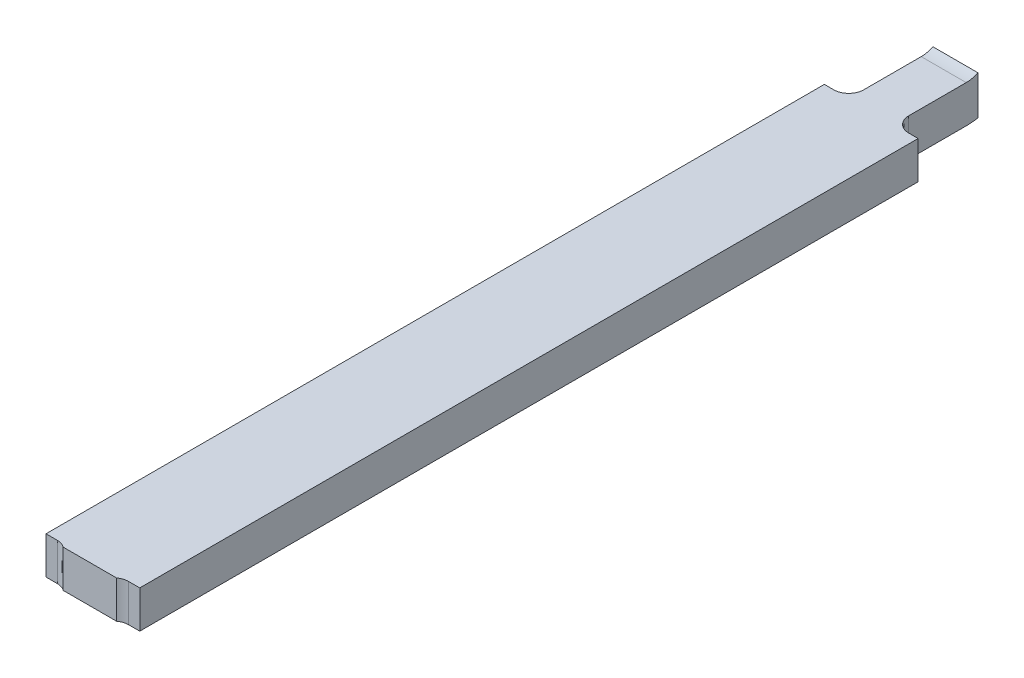
ISO-10303-21;
HEADER;
FILE_DESCRIPTION(('STEP AP214'),'2;1');
FILE_NAME('part.step','',(''),(''),'','','');
FILE_SCHEMA(('AUTOMOTIVE_DESIGN { 1 0 10303 214 1 1 1 1 }'));
ENDSEC;
DATA;
#1=APPLICATION_CONTEXT('core data for automotive mechanical design processes');
#2=APPLICATION_PROTOCOL_DEFINITION('international standard','automotive_design',2000,#1);
#3=PRODUCT_CONTEXT('',#1,'mechanical');
#4=PRODUCT('Part','Part','',(#3));
#5=PRODUCT_RELATED_PRODUCT_CATEGORY('part','',(#4));
#6=PRODUCT_DEFINITION_FORMATION('','',#4);
#7=PRODUCT_DEFINITION_CONTEXT('part definition',#1,'design');
#8=PRODUCT_DEFINITION('design','',#6,#7);
#9=PRODUCT_DEFINITION_SHAPE('','',#8);
#10=(LENGTH_UNIT() NAMED_UNIT(*) SI_UNIT(.MILLI.,.METRE.));
#11=(NAMED_UNIT(*) PLANE_ANGLE_UNIT() SI_UNIT($,.RADIAN.));
#12=(NAMED_UNIT(*) SI_UNIT($,.STERADIAN.) SOLID_ANGLE_UNIT());
#13=UNCERTAINTY_MEASURE_WITH_UNIT(LENGTH_MEASURE(1.E-05),#10,'distance_accuracy_value','');
#14=(GEOMETRIC_REPRESENTATION_CONTEXT(3) GLOBAL_UNCERTAINTY_ASSIGNED_CONTEXT((#13)) GLOBAL_UNIT_ASSIGNED_CONTEXT((#10,
#11,#12)) REPRESENTATION_CONTEXT('',''));
#15=CARTESIAN_POINT('',(0.,0.,0.));
#16=DIRECTION('',(0.,0.,1.));
#17=DIRECTION('',(1.,0.,0.));
#18=AXIS2_PLACEMENT_3D('',#15,#16,#17);
#19=CARTESIAN_POINT('',(3.,-0.3652289464185,-7.500488855463));
#20=DIRECTION('',(0.,0.,1.));
#21=DIRECTION('',(1.,0.,0.));
#22=AXIS2_PLACEMENT_3D('',#19,#20,#21);
#23=PLANE('',#22);
#24=DIRECTION('',(0.,1.,0.));
#25=VECTOR('',#24,1.);
#26=CARTESIAN_POINT('',(3.12,-0.3694122088881,-7.500488855463));
#27=LINE('',#26,#25);
#28=CARTESIAN_POINT('',(3.12,-0.469296338681694,-7.50048885546298));
#29=VERTEX_POINT('',#28);
#30=CARTESIAN_POINT('',(3.12,-0.261161554155171,-7.50048885546301));
#31=VERTEX_POINT('',#30);
#32=EDGE_CURVE('E150',#29,#31,#27,.T.);
#33=ORIENTED_EDGE('',*,*,#32,.F.);
#34=DIRECTION('',(-1.,0.,0.));
#35=VECTOR('',#34,1.);
#36=CARTESIAN_POINT('',(3.125727283719,-0.469296338681697,-7.50048885546296));
#37=LINE('',#36,#35);
#38=CARTESIAN_POINT('',(2.88,-0.469296338681694,-7.50048885546298));
#39=VERTEX_POINT('',#38);
#40=EDGE_CURVE('E139',#39,#29,#37,.F.);
#41=ORIENTED_EDGE('',*,*,#40,.F.);
#42=DIRECTION('',(0.,1.,0.));
#43=VECTOR('',#42,1.);
#44=CARTESIAN_POINT('',(2.88,-0.3694122088881,-7.500488855463));
#45=LINE('',#44,#43);
#46=CARTESIAN_POINT('',(2.88,-0.261161554155171,-7.50048885546301));
#47=VERTEX_POINT('',#46);
#48=EDGE_CURVE('E535',#39,#47,#45,.T.);
#49=ORIENTED_EDGE('',*,*,#48,.T.);
#50=DIRECTION('',(1.,0.,0.));
#51=VECTOR('',#50,1.);
#52=CARTESIAN_POINT('',(2.874272716281,-0.261161554155164,-7.50048885546303));
#53=LINE('',#52,#51);
#54=EDGE_CURVE('E147',#47,#31,#53,.T.);
#55=ORIENTED_EDGE('',*,*,#54,.T.);
#56=EDGE_LOOP('',(#33,#41,#49,#55));
#57=FACE_BOUND('',#56,.T.);
#58=ADVANCED_FACE('F17',(#57),#23,.F.);
#59=CARTESIAN_POINT('',(3.125727283719,-0.125,-7.43756007691));
#60=DIRECTION('',(-1.,0.,0.));
#61=DIRECTION('',(0.,0.,1.));
#62=AXIS2_PLACEMENT_3D('',#59,#60,#61);
#63=CYLINDRICAL_SURFACE('',#62,0.3499999999997);
#64=CARTESIAN_POINT('',(2.88,-0.125,-7.43756007691));
#65=DIRECTION('',(-1.,0.,0.));
#66=DIRECTION('',(0.,0.,1.));
#67=AXIS2_PLACEMENT_3D('',#64,#65,#66);
#68=CIRCLE('',#67,0.3499999999997);
#69=CARTESIAN_POINT('',(2.88,-0.475,-7.43756007691));
#70=VERTEX_POINT('',#69);
#71=EDGE_CURVE('E250',#70,#39,#68,.F.);
#72=ORIENTED_EDGE('',*,*,#71,.T.);
#73=ORIENTED_EDGE('',*,*,#40,.T.);
#74=CARTESIAN_POINT('',(3.12,-0.125,-7.43756007691));
#75=DIRECTION('',(-1.,0.,0.));
#76=DIRECTION('',(0.,0.,1.));
#77=AXIS2_PLACEMENT_3D('',#74,#75,#76);
#78=CIRCLE('',#77,0.3499999999997);
#79=CARTESIAN_POINT('',(3.12,-0.475,-7.43756007691));
#80=VERTEX_POINT('',#79);
#81=EDGE_CURVE('E274',#80,#29,#78,.F.);
#82=ORIENTED_EDGE('',*,*,#81,.F.);
#83=DIRECTION('',(1.,0.,0.));
#84=VECTOR('',#83,1.);
#85=CARTESIAN_POINT('',(3.,-0.475,-7.43756007691));
#86=LINE('',#85,#84);
#87=EDGE_CURVE('E138',#80,#70,#86,.F.);
#88=ORIENTED_EDGE('',*,*,#87,.T.);
#89=EDGE_LOOP('',(#72,#73,#82,#88));
#90=FACE_BOUND('',#89,.T.);
#91=ADVANCED_FACE('F255',(#90),#63,.T.);
#92=CARTESIAN_POINT('',(3.,-0.475,-5.160844573418));
#93=DIRECTION('',(0.,1.,0.));
#94=DIRECTION('',(0.,0.,1.));
#95=AXIS2_PLACEMENT_3D('',#92,#93,#94);
#96=PLANE('',#95);
#97=DIRECTION('',(1.,0.,0.));
#98=VECTOR('',#97,1.);
#99=CARTESIAN_POINT('',(3.,-0.475,-2.9));
#100=LINE('',#99,#98);
#101=CARTESIAN_POINT('',(2.75,-0.475,-2.9));
#102=VERTEX_POINT('',#101);
#103=CARTESIAN_POINT('',(2.81,-0.475,-2.89999999999976));
#104=VERTEX_POINT('',#103);
#105=EDGE_CURVE('E118',#102,#104,#100,.T.);
#106=ORIENTED_EDGE('',*,*,#105,.F.);
#107=DIRECTION('',(0.,0.,-1.));
#108=VECTOR('',#107,1.);
#109=CARTESIAN_POINT('',(2.75,-0.475,-4.975579331992));
#110=LINE('',#109,#108);
#111=CARTESIAN_POINT('',(2.75,-0.475,-7.051158663985));
#112=VERTEX_POINT('',#111);
#113=EDGE_CURVE('E213',#102,#112,#110,.T.);
#114=ORIENTED_EDGE('',*,*,#113,.T.);
#115=DIRECTION('',(1.,0.,0.));
#116=VECTOR('',#115,1.);
#117=CARTESIAN_POINT('',(2.775,-0.475,-7.051158663985));
#118=LINE('',#117,#116);
#119=CARTESIAN_POINT('',(2.8,-0.475,-7.05115866398505));
#120=VERTEX_POINT('',#119);
#121=EDGE_CURVE('E218',#112,#120,#118,.T.);
#122=ORIENTED_EDGE('',*,*,#121,.T.);
#123=CARTESIAN_POINT('',(2.88000000000032,-0.475,-7.131158663985));
#124=CARTESIAN_POINT('',(2.87999112440513,-0.475,-7.12663228539964));
#125=CARTESIAN_POINT('',(2.87960496952686,-0.475,-7.12211245444064));
#126=CARTESIAN_POINT('',(2.87808437325865,-0.475,-7.11320506981294));
#127=CARTESIAN_POINT('',(2.87695060689905,-0.475,-7.10881740054697));
#128=CARTESIAN_POINT('',(2.87244381446599,-0.475,-7.09604021502532));
#129=CARTESIAN_POINT('',(2.86796518134959,-0.475,-7.08801257629076));
#130=CARTESIAN_POINT('',(2.85665881135733,-0.475,-7.07397145931291));
#131=CARTESIAN_POINT('',(2.84985092513136,-0.475,-7.06794178198465));
#132=CARTESIAN_POINT('',(2.83457018431965,-0.475,-7.05845747919414));
#133=CARTESIAN_POINT('',(2.82608908375478,-0.475,-7.05501603051907));
#134=CARTESIAN_POINT('',(2.81161549132932,-0.475,-7.05178938735803));
#135=CARTESIAN_POINT('',(2.80580339960844,-0.475,-7.05114165155808));
#136=CARTESIAN_POINT('',(2.8,-0.475,-7.05115866398511));
#137=B_SPLINE_CURVE_WITH_KNOTS('',3,(#123,#124,#125,#126,#127,#128,#129,#130,#131,#132,#133,
#134,#135,#136),.UNSPECIFIED.,.F.,.F.,(4,2,2,2,2,2,4),(0.,0.0135512792184664,0.0270903394942172,
0.0541002294469011,0.080885440746927,0.107806110463965,0.125207976056706),.UNSPECIFIED.);
#138=CARTESIAN_POINT('',(2.88000000000016,-0.475,-7.131158663985));
#139=VERTEX_POINT('',#138);
#140=EDGE_CURVE('E239',#139,#120,#137,.T.);
#141=ORIENTED_EDGE('',*,*,#140,.F.);
#142=DIRECTION('',(0.,0.,-1.));
#143=VECTOR('',#142,1.);
#144=CARTESIAN_POINT('',(2.88,-0.475,-7.317732357319));
#145=LINE('',#144,#143);
#146=EDGE_CURVE('E537',#139,#70,#145,.T.);
#147=ORIENTED_EDGE('',*,*,#146,.T.);
#148=ORIENTED_EDGE('',*,*,#87,.F.);
#149=DIRECTION('',(0.,0.,-1.));
#150=VECTOR('',#149,1.);
#151=CARTESIAN_POINT('',(3.12,-0.475,-7.317732357319));
#152=LINE('',#151,#150);
#153=CARTESIAN_POINT('',(3.12000000000005,-0.475,-7.131158663985));
#154=VERTEX_POINT('',#153);
#155=EDGE_CURVE('E533',#154,#80,#152,.T.);
#156=ORIENTED_EDGE('',*,*,#155,.F.);
#157=CARTESIAN_POINT('',(3.2,-0.475,-7.05115866398468));
#158=CARTESIAN_POINT('',(3.19547362141464,-0.475,-7.05116753957987));
#159=CARTESIAN_POINT('',(3.19095379045565,-0.475,-7.05155369445814));
#160=CARTESIAN_POINT('',(3.18204640582795,-0.475,-7.05307429072634));
#161=CARTESIAN_POINT('',(3.17765873656198,-0.475,-7.05420805708594));
#162=CARTESIAN_POINT('',(3.16488155104034,-0.475,-7.058714849519));
#163=CARTESIAN_POINT('',(3.15685391230579,-0.475,-7.06319348263539));
#164=CARTESIAN_POINT('',(3.14281279532794,-0.475,-7.07449985262764));
#165=CARTESIAN_POINT('',(3.13678311799969,-0.475,-7.0813077388536));
#166=CARTESIAN_POINT('',(3.12729881520917,-0.475,-7.0965884796653));
#167=CARTESIAN_POINT('',(3.12385736653408,-0.475,-7.10506958023018));
#168=CARTESIAN_POINT('',(3.12063072337303,-0.475,-7.11954317265566));
#169=CARTESIAN_POINT('',(3.11998298757307,-0.475,-7.12535526437655));
#170=CARTESIAN_POINT('',(3.12000000000011,-0.475,-7.131158663985));
#171=B_SPLINE_CURVE_WITH_KNOTS('',3,(#157,#158,#159,#160,#161,#162,#163,#164,#165,#166,#167,
#168,#169,#170),.UNSPECIFIED.,.F.,.F.,(4,2,2,2,2,2,4),(0.,0.0135512792184578,0.0270903394941992,
0.0541002294468632,0.0808854407468641,0.107806110463927,0.125207976056708),.UNSPECIFIED.);
#172=CARTESIAN_POINT('',(3.2,-0.475,-7.05115866398484));
#173=VERTEX_POINT('',#172);
#174=EDGE_CURVE('E266',#173,#154,#171,.T.);
#175=ORIENTED_EDGE('',*,*,#174,.F.);
#176=DIRECTION('',(1.,0.,0.));
#177=VECTOR('',#176,1.);
#178=CARTESIAN_POINT('',(3.225,-0.475,-7.051158663985));
#179=LINE('',#178,#177);
#180=CARTESIAN_POINT('',(3.25,-0.475,-7.051158663985));
#181=VERTEX_POINT('',#180);
#182=EDGE_CURVE('E151',#173,#181,#179,.T.);
#183=ORIENTED_EDGE('',*,*,#182,.T.);
#184=DIRECTION('',(0.,0.,-1.));
#185=VECTOR('',#184,1.);
#186=CARTESIAN_POINT('',(3.25,-0.475,-4.975579331992));
#187=LINE('',#186,#185);
#188=CARTESIAN_POINT('',(3.25,-0.475,-2.9));
#189=VERTEX_POINT('',#188);
#190=EDGE_CURVE('E155',#189,#181,#187,.T.);
#191=ORIENTED_EDGE('',*,*,#190,.F.);
#192=DIRECTION('',(1.,0.,0.));
#193=VECTOR('',#192,1.);
#194=CARTESIAN_POINT('',(3.22,-0.475,-2.9));
#195=LINE('',#194,#193);
#196=CARTESIAN_POINT('',(3.19,-0.475,-2.89999999999989));
#197=VERTEX_POINT('',#196);
#198=EDGE_CURVE('E163',#197,#189,#195,.T.);
#199=ORIENTED_EDGE('',*,*,#198,.F.);
#200=CARTESIAN_POINT('',(3.14217544757885,-0.475,-2.8841290699251));
#201=CARTESIAN_POINT('',(3.14622022070471,-0.475,-2.88715347788678));
#202=CARTESIAN_POINT('',(3.1505544258207,-0.475,-2.88978498732686));
#203=CARTESIAN_POINT('',(3.15913369497632,-0.475,-2.8939430866676));
#204=CARTESIAN_POINT('',(3.16333518410899,-0.475,-2.89555994023161));
#205=CARTESIAN_POINT('',(3.17194880942199,-0.475,-2.89806057790455));
#206=CARTESIAN_POINT('',(3.17636081104943,-0.475,-2.89894482380699));
#207=CARTESIAN_POINT('',(3.18386363483118,-0.475,-2.89981357444961));
#208=CARTESIAN_POINT('',(3.18693284156798,-0.475,-2.89999375978714));
#209=CARTESIAN_POINT('',(3.19,-0.475,-2.89999999999978));
#210=B_SPLINE_CURVE_WITH_KNOTS('',3,(#200,#201,#202,#203,#204,#205,#206,#207,#208,#209),
.UNSPECIFIED.,.F.,.F.,(4,2,2,2,4),(0.,0.0151223248428414,0.0285648972663061,0.0419989898086721,
0.0512012871013961),.UNSPECIFIED.);
#211=CARTESIAN_POINT('',(3.14217544757892,-0.475,-2.88412906992505));
#212=VERTEX_POINT('',#211);
#213=EDGE_CURVE('E125',#212,#197,#210,.T.);
#214=ORIENTED_EDGE('',*,*,#213,.F.);
#215=DIRECTION('',(1.,0.,0.));
#216=VECTOR('',#215,1.);
#217=CARTESIAN_POINT('',(3.,-0.475,-2.884129069925));
#218=LINE('',#217,#216);
#219=CARTESIAN_POINT('',(2.85782456637205,-0.475,-2.88412906992502));
#220=VERTEX_POINT('',#219);
#221=EDGE_CURVE('E129',#220,#212,#218,.T.);
#222=ORIENTED_EDGE('',*,*,#221,.F.);
#223=CARTESIAN_POINT('',(2.81,-0.475,-2.89999999999952));
#224=CARTESIAN_POINT('',(2.81503269638164,-0.475,-2.90001482409384));
#225=CARTESIAN_POINT('',(2.82008184216692,-0.475,-2.89952557596737));
#226=CARTESIAN_POINT('',(2.83385228395105,-0.475,-2.89686256447201));
#227=CARTESIAN_POINT('',(2.84239947608122,-0.475,-2.89367998586962));
#228=CARTESIAN_POINT('',(2.85280786570125,-0.475,-2.88765952253235));
#229=CARTESIAN_POINT('',(2.85537440128386,-0.475,-2.88596721904186));
#230=CARTESIAN_POINT('',(2.8578245663721,-0.475,-2.88412906992503));
#231=B_SPLINE_CURVE_WITH_KNOTS('',3,(#223,#224,#225,#226,#227,#228,#229,#230),.UNSPECIFIED.,.F.,
.F.,(4,2,2,4),(0.,0.0151178951010498,0.0419060489798819,0.051106340202069),.UNSPECIFIED.);
#232=EDGE_CURVE('E20',#104,#220,#231,.T.);
#233=ORIENTED_EDGE('',*,*,#232,.F.);
#234=EDGE_LOOP('',(#106,#114,#122,#141,#147,#148,#156,#175,#183,#191,#199,#214,#222,#233));
#235=FACE_BOUND('',#234,.T.);
#236=ADVANCED_FACE('F135',(#235),#96,.F.);
#237=CARTESIAN_POINT('',(3.192867608479,-0.269272716281,-2.899957930186));
#238=CARTESIAN_POINT('',(3.191912675517,-0.269272716281,-2.899988554812));
#239=CARTESIAN_POINT('',(3.185731487658,-0.269272716281,-2.900079343105));
#240=CARTESIAN_POINT('',(3.174291413689,-0.269272716281,-2.898963559635));
#241=CARTESIAN_POINT('',(3.159190917084,-0.269272716281,-2.894390814224));
#242=CARTESIAN_POINT('',(3.1486873263,-0.269272716281,-2.888776760997));
#243=CARTESIAN_POINT('',(3.141721023167,-0.269272716281,-2.883851645707));
#244=CARTESIAN_POINT('',(3.139152051861,-0.269272716281,-2.881786274905));
#245=CARTESIAN_POINT('',(3.137705478113,-0.269272716281,-2.880535760884));
#246=(BOUNDED_CURVE() B_SPLINE_CURVE(3,(#237,#238,#239,#240,#241,#242,#243,#244,#245),
.UNSPECIFIED.,.F.,.F.) B_SPLINE_CURVE_WITH_KNOTS((4,1,1,1,1,1,4),(0.,0.04800761260771,
0.3103664664067,0.5726487803877,0.8349383013298,0.9041878403074,1.),
.UNSPECIFIED.) CURVE() GEOMETRIC_REPRESENTATION_ITEM() RATIONAL_B_SPLINE_CURVE((1.,1.,1.,1.,1.,
1.,1.,1.,1.)) REPRESENTATION_ITEM(''));
#247=DIRECTION('',(0.,-1.,0.));
#248=VECTOR('',#247,1.);
#249=SURFACE_OF_LINEAR_EXTRUSION('',#246,#248);
#250=CARTESIAN_POINT('',(3.14217544464746,-0.275,-2.88412906773656));
#251=CARTESIAN_POINT('',(3.14622021763433,-0.275,-2.88715347588347));
#252=CARTESIAN_POINT('',(3.15055442262976,-0.275,-2.88978498552233));
#253=CARTESIAN_POINT('',(3.15913369159402,-0.275,-2.89394308525624));
#254=CARTESIAN_POINT('',(3.16333518065168,-0.275,-2.89555993901277));
#255=CARTESIAN_POINT('',(3.17194880584974,-0.275,-2.89806057708111));
#256=CARTESIAN_POINT('',(3.17636080743733,-0.275,-2.89894482318606));
#257=CARTESIAN_POINT('',(3.18386363239327,-0.275,-2.89981357430863));
#258=CARTESIAN_POINT('',(3.18693284034916,-0.275,-2.89999375978684));
#259=CARTESIAN_POINT('',(3.19,-0.275,-2.89999999999978));
#260=B_SPLINE_CURVE_WITH_KNOTS('',3,(#250,#251,#252,#253,#254,#255,#256,#257,#258,#259),
.UNSPECIFIED.,.F.,.F.,(4,2,2,2,4),(0.,0.015122324842671,0.0285648972632469,0.041998989809668,
0.0512012907536534),.UNSPECIFIED.);
#261=CARTESIAN_POINT('',(3.14217544611323,-0.275,-2.88412906883078));
#262=VERTEX_POINT('',#261);
#263=CARTESIAN_POINT('',(3.19,-0.275,-2.9));
#264=VERTEX_POINT('',#263);
#265=EDGE_CURVE('E132',#262,#264,#260,.T.);
#266=ORIENTED_EDGE('',*,*,#265,.F.);
#267=DIRECTION('',(0.,1.,0.));
#268=VECTOR('',#267,1.);
#269=CARTESIAN_POINT('',(3.142175447579,-0.375,-2.884129069925));
#270=LINE('',#269,#268);
#271=EDGE_CURVE('E133',#212,#262,#270,.T.);
#272=ORIENTED_EDGE('',*,*,#271,.F.);
#273=ORIENTED_EDGE('',*,*,#213,.T.);
#274=DIRECTION('',(0.,1.,0.));
#275=VECTOR('',#274,1.);
#276=CARTESIAN_POINT('',(3.19,-0.375,-2.9));
#277=LINE('',#276,#275);
#278=EDGE_CURVE('E166',#264,#197,#277,.F.);
#279=ORIENTED_EDGE('',*,*,#278,.F.);
#280=EDGE_LOOP('',(#266,#272,#273,#279));
#281=FACE_BOUND('',#280,.T.);
#282=ADVANCED_FACE('F254',(#281),#249,.T.);
#283=CARTESIAN_POINT('',(3.22,-0.375,-2.9));
#284=DIRECTION('',(0.,0.,1.));
#285=DIRECTION('',(1.,0.,0.));
#286=AXIS2_PLACEMENT_3D('',#283,#284,#285);
#287=PLANE('',#286);
#288=DIRECTION('',(0.,1.,0.));
#289=VECTOR('',#288,1.);
#290=CARTESIAN_POINT('',(3.25,-0.375,-2.9));
#291=LINE('',#290,#289);
#292=CARTESIAN_POINT('',(3.25,-0.275,-2.9));
#293=VERTEX_POINT('',#292);
#294=EDGE_CURVE('E160',#293,#189,#291,.F.);
#295=ORIENTED_EDGE('',*,*,#294,.F.);
#296=DIRECTION('',(1.,0.,0.));
#297=VECTOR('',#296,1.);
#298=CARTESIAN_POINT('',(3.,-0.275,-2.9));
#299=LINE('',#298,#297);
#300=EDGE_CURVE('E306',#264,#293,#299,.T.);
#301=ORIENTED_EDGE('',*,*,#300,.F.);
#302=ORIENTED_EDGE('',*,*,#278,.T.);
#303=ORIENTED_EDGE('',*,*,#198,.T.);
#304=EDGE_LOOP('',(#295,#301,#302,#303));
#305=FACE_BOUND('',#304,.T.);
#306=ADVANCED_FACE('F368',(#305),#287,.T.);
#307=CARTESIAN_POINT('',(3.25,-0.375,-4.975579331992));
#308=DIRECTION('',(1.,0.,0.));
#309=DIRECTION('',(0.,0.,-1.));
#310=AXIS2_PLACEMENT_3D('',#307,#308,#309);
#311=PLANE('',#310);
#312=DIRECTION('',(0.,1.,0.));
#313=VECTOR('',#312,1.);
#314=CARTESIAN_POINT('',(3.25,-0.375,-7.051158663985));
#315=LINE('',#314,#313);
#316=CARTESIAN_POINT('',(3.25,-0.275,-7.051158663985));
#317=VERTEX_POINT('',#316);
#318=EDGE_CURVE('E154',#181,#317,#315,.T.);
#319=ORIENTED_EDGE('',*,*,#318,.T.);
#320=DIRECTION('',(0.,0.,1.));
#321=VECTOR('',#320,1.);
#322=CARTESIAN_POINT('',(3.25,-0.275,-5.160844573418));
#323=LINE('',#322,#321);
#324=EDGE_CURVE('E302',#293,#317,#323,.F.);
#325=ORIENTED_EDGE('',*,*,#324,.F.);
#326=ORIENTED_EDGE('',*,*,#294,.T.);
#327=ORIENTED_EDGE('',*,*,#190,.T.);
#328=EDGE_LOOP('',(#319,#325,#326,#327));
#329=FACE_BOUND('',#328,.T.);
#330=ADVANCED_FACE('F373',(#329),#311,.T.);
#331=CARTESIAN_POINT('',(3.225,-0.375,-7.051158663985));
#332=DIRECTION('',(0.,0.,1.));
#333=DIRECTION('',(1.,0.,0.));
#334=AXIS2_PLACEMENT_3D('',#331,#332,#333);
#335=PLANE('',#334);
#336=ORIENTED_EDGE('',*,*,#182,.F.);
#337=DIRECTION('',(0.,-1.,0.));
#338=VECTOR('',#337,1.);
#339=CARTESIAN_POINT('',(3.2,-0.269272716281,-7.05115866398468));
#340=LINE('',#339,#338);
#341=CARTESIAN_POINT('',(3.2,-0.275,-7.05115866398476));
#342=VERTEX_POINT('',#341);
#343=EDGE_CURVE('E273',#342,#173,#340,.T.);
#344=ORIENTED_EDGE('',*,*,#343,.F.);
#345=DIRECTION('',(1.,0.,0.));
#346=VECTOR('',#345,1.);
#347=CARTESIAN_POINT('',(3.,-0.275,-7.051158663985));
#348=LINE('',#347,#346);
#349=EDGE_CURVE('E305',#317,#342,#348,.F.);
#350=ORIENTED_EDGE('',*,*,#349,.F.);
#351=ORIENTED_EDGE('',*,*,#318,.F.);
#352=EDGE_LOOP('',(#336,#344,#350,#351));
#353=FACE_BOUND('',#352,.T.);
#354=ADVANCED_FACE('F283',(#353),#335,.F.);
#355=CARTESIAN_POINT('',(3.120042070413,-0.269272716281,-7.134026291144));
#356=CARTESIAN_POINT('',(3.120011445371,-0.269272716281,-7.133071351971));
#357=CARTESIAN_POINT('',(3.119920656285,-0.269272716281,-7.126890157897));
#358=CARTESIAN_POINT('',(3.121036440365,-0.269272716281,-7.115450077674));
#359=CARTESIAN_POINT('',(3.125609185776,-0.269272716281,-7.100349581069));
#360=CARTESIAN_POINT('',(3.133048947975,-0.269272716281,-7.086430187272));
#361=CARTESIAN_POINT('',(3.143068695624,-0.269272716281,-7.074236320435));
#362=CARTESIAN_POINT('',(3.155262096496,-0.269272716281,-7.064213675467));
#363=CARTESIAN_POINT('',(3.169183798376,-0.269272716281,-7.056770327068));
#364=CARTESIAN_POINT('',(3.184287959508,-0.269272716281,-7.05219575577));
#365=CARTESIAN_POINT('',(3.195729514596,-0.269272716281,-7.051079350384));
#366=CARTESIAN_POINT('',(3.201910679261,-0.269272716281,-7.051170096432));
#367=CARTESIAN_POINT('',(3.202864618741,-0.269272716281,-7.0512006723));
#368=(BOUNDED_CURVE() B_SPLINE_CURVE(3,(#355,#356,#357,#358,#359,#360,#361,#362,#363,#364,#365,
#366,#367),.UNSPECIFIED.,.F.,.F.) B_SPLINE_CURVE_WITH_KNOTS((4,1,1,1,1,1,1,1,1,1,4),(0.,
0.02187366901521,0.1414112381412,0.260913933719,0.380419912977,0.4999590271853,0.6195124003892,
0.7390518477007,0.8585895788734,0.9781493142558,1.),
.UNSPECIFIED.) CURVE() GEOMETRIC_REPRESENTATION_ITEM() RATIONAL_B_SPLINE_CURVE((1.,1.,1.,1.,1.,
1.,1.,1.,1.,1.,1.,1.,1.)) REPRESENTATION_ITEM(''));
#369=DIRECTION('',(0.,-1.,0.));
#370=VECTOR('',#369,1.);
#371=SURFACE_OF_LINEAR_EXTRUSION('',#368,#370);
#372=DIRECTION('',(0.,1.,0.));
#373=VECTOR('',#372,1.);
#374=CARTESIAN_POINT('',(3.12,-0.3694122088881,-7.131158663985));
#375=LINE('',#374,#373);
#376=CARTESIAN_POINT('',(3.12,-0.275,-7.131158663985));
#377=VERTEX_POINT('',#376);
#378=EDGE_CURVE('E272',#377,#154,#375,.F.);
#379=ORIENTED_EDGE('',*,*,#378,.F.);
#380=CARTESIAN_POINT('',(3.2,-0.275,-7.05115866398468));
#381=CARTESIAN_POINT('',(3.19547362141464,-0.275,-7.05116753957987));
#382=CARTESIAN_POINT('',(3.19095379045565,-0.275,-7.05155369445814));
#383=CARTESIAN_POINT('',(3.18204640582795,-0.275,-7.05307429072634));
#384=CARTESIAN_POINT('',(3.17765873656198,-0.275,-7.05420805708594));
#385=CARTESIAN_POINT('',(3.16488155104034,-0.275,-7.058714849519));
#386=CARTESIAN_POINT('',(3.15685391230579,-0.275,-7.06319348263539));
#387=CARTESIAN_POINT('',(3.14281279532794,-0.275,-7.07449985262764));
#388=CARTESIAN_POINT('',(3.13678311799969,-0.275,-7.0813077388536));
#389=CARTESIAN_POINT('',(3.12729881520917,-0.275,-7.0965884796653));
#390=CARTESIAN_POINT('',(3.12385736653408,-0.275,-7.10506958023018));
#391=CARTESIAN_POINT('',(3.12063072337303,-0.275,-7.11954317265566));
#392=CARTESIAN_POINT('',(3.11998298757307,-0.275,-7.12535526437655));
#393=CARTESIAN_POINT('',(3.12000000000011,-0.275,-7.131158663985));
#394=B_SPLINE_CURVE_WITH_KNOTS('',3,(#380,#381,#382,#383,#384,#385,#386,#387,#388,#389,#390,
#391,#392,#393),.UNSPECIFIED.,.F.,.F.,(4,2,2,2,2,2,4),(0.,0.0135512792184578,0.0270903394941992,
0.0541002294468632,0.0808854407468641,0.107806110463927,0.125207976056708),.UNSPECIFIED.);
#395=EDGE_CURVE('E355',#342,#377,#394,.T.);
#396=ORIENTED_EDGE('',*,*,#395,.F.);
#397=ORIENTED_EDGE('',*,*,#343,.T.);
#398=ORIENTED_EDGE('',*,*,#174,.T.);
#399=EDGE_LOOP('',(#379,#396,#397,#398));
#400=FACE_BOUND('',#399,.T.);
#401=ADVANCED_FACE('F276',(#400),#371,.T.);
#402=CARTESIAN_POINT('',(3.12,-0.3694122088881,-7.317732357319));
#403=DIRECTION('',(1.,0.,0.));
#404=DIRECTION('',(0.,0.,-1.));
#405=AXIS2_PLACEMENT_3D('',#402,#403,#404);
#406=PLANE('',#405);
#407=ORIENTED_EDGE('',*,*,#81,.T.);
#408=ORIENTED_EDGE('',*,*,#32,.T.);
#409=CARTESIAN_POINT('',(3.12,-0.125,-7.437560076911));
#410=DIRECTION('',(1.,0.,0.));
#411=DIRECTION('',(0.,0.,-1.));
#412=AXIS2_PLACEMENT_3D('',#409,#410,#411);
#413=CIRCLE('',#412,0.15);
#414=CARTESIAN_POINT('',(3.12,-0.275,-7.437560076911));
#415=VERTEX_POINT('',#414);
#416=EDGE_CURVE('E149',#31,#415,#413,.F.);
#417=ORIENTED_EDGE('',*,*,#416,.T.);
#418=DIRECTION('',(0.,0.,1.));
#419=VECTOR('',#418,1.);
#420=CARTESIAN_POINT('',(3.12,-0.275,-5.160844573418));
#421=LINE('',#420,#419);
#422=EDGE_CURVE('E348',#377,#415,#421,.F.);
#423=ORIENTED_EDGE('',*,*,#422,.F.);
#424=ORIENTED_EDGE('',*,*,#378,.T.);
#425=ORIENTED_EDGE('',*,*,#155,.T.);
#426=EDGE_LOOP('',(#407,#408,#417,#423,#424,#425));
#427=FACE_BOUND('',#426,.T.);
#428=ADVANCED_FACE('F282',(#427),#406,.T.);
#429=CARTESIAN_POINT('',(2.874272716281,-0.125,-7.437560076911));
#430=DIRECTION('',(1.,0.,0.));
#431=DIRECTION('',(0.,0.,-1.));
#432=AXIS2_PLACEMENT_3D('',#429,#430,#431);
#433=CYLINDRICAL_SURFACE('',#432,0.15);
#434=DIRECTION('',(1.,0.,0.));
#435=VECTOR('',#434,1.);
#436=CARTESIAN_POINT('',(3.,-0.275,-7.437560076911));
#437=LINE('',#436,#435);
#438=CARTESIAN_POINT('',(2.88,-0.275,-7.437560076911));
#439=VERTEX_POINT('',#438);
#440=EDGE_CURVE('E346',#415,#439,#437,.F.);
#441=ORIENTED_EDGE('',*,*,#440,.F.);
#442=ORIENTED_EDGE('',*,*,#416,.F.);
#443=ORIENTED_EDGE('',*,*,#54,.F.);
#444=CARTESIAN_POINT('',(2.88,-0.125,-7.437560076911));
#445=DIRECTION('',(1.,0.,0.));
#446=DIRECTION('',(0.,0.,-1.));
#447=AXIS2_PLACEMENT_3D('',#444,#445,#446);
#448=CIRCLE('',#447,0.15);
#449=EDGE_CURVE('E536',#47,#439,#448,.F.);
#450=ORIENTED_EDGE('',*,*,#449,.T.);
#451=EDGE_LOOP('',(#441,#442,#443,#450));
#452=FACE_BOUND('',#451,.T.);
#453=ADVANCED_FACE('F443',(#452),#433,.F.);
#454=CARTESIAN_POINT('',(2.88,-0.3694122088881,-7.317732357319));
#455=DIRECTION('',(1.,0.,0.));
#456=DIRECTION('',(0.,0.,-1.));
#457=AXIS2_PLACEMENT_3D('',#454,#455,#456);
#458=PLANE('',#457);
#459=ORIENTED_EDGE('',*,*,#146,.F.);
#460=DIRECTION('',(0.,-1.,0.));
#461=VECTOR('',#460,1.);
#462=CARTESIAN_POINT('',(2.88000000000032,-0.269272716281,-7.131158663985));
#463=LINE('',#462,#461);
#464=CARTESIAN_POINT('',(2.88000000000024,-0.275,-7.131158663985));
#465=VERTEX_POINT('',#464);
#466=EDGE_CURVE('E223',#465,#139,#463,.T.);
#467=ORIENTED_EDGE('',*,*,#466,.F.);
#468=DIRECTION('',(0.,0.,1.));
#469=VECTOR('',#468,1.);
#470=CARTESIAN_POINT('',(2.88,-0.275,-5.160844573418));
#471=LINE('',#470,#469);
#472=EDGE_CURVE('E345',#439,#465,#471,.T.);
#473=ORIENTED_EDGE('',*,*,#472,.F.);
#474=ORIENTED_EDGE('',*,*,#449,.F.);
#475=ORIENTED_EDGE('',*,*,#48,.F.);
#476=ORIENTED_EDGE('',*,*,#71,.F.);
#477=EDGE_LOOP('',(#459,#467,#473,#474,#475,#476));
#478=FACE_BOUND('',#477,.T.);
#479=ADVANCED_FACE('F234',(#478),#458,.F.);
#480=CARTESIAN_POINT('',(2.797132372841,-0.269272716281,-7.051200734398));
#481=CARTESIAN_POINT('',(2.798087312014,-0.269272716281,-7.051170109356));
#482=CARTESIAN_POINT('',(2.804268506088,-0.269272716281,-7.05107932027));
#483=CARTESIAN_POINT('',(2.815708586311,-0.269272716281,-7.05219510435));
#484=CARTESIAN_POINT('',(2.830809082916,-0.269272716281,-7.056767849761));
#485=CARTESIAN_POINT('',(2.844728476713,-0.269272716281,-7.06420761196));
#486=CARTESIAN_POINT('',(2.85692234355,-0.269272716281,-7.074227359609));
#487=CARTESIAN_POINT('',(2.866944988518,-0.269272716281,-7.086420760481));
#488=CARTESIAN_POINT('',(2.874388336917,-0.269272716281,-7.100342462361));
#489=CARTESIAN_POINT('',(2.878962908215,-0.269272716281,-7.115446623493));
#490=CARTESIAN_POINT('',(2.880079313601,-0.269272716281,-7.126888178581));
#491=CARTESIAN_POINT('',(2.879988567553,-0.269272716281,-7.133069343246));
#492=CARTESIAN_POINT('',(2.879957991685,-0.269272716281,-7.134023282726));
#493=(BOUNDED_CURVE() B_SPLINE_CURVE(3,(#480,#481,#482,#483,#484,#485,#486,#487,#488,#489,#490,
#491,#492),.UNSPECIFIED.,.F.,.F.) B_SPLINE_CURVE_WITH_KNOTS((4,1,1,1,1,1,1,1,1,1,4),(0.,
0.02187366901522,0.1414112381413,0.260913933719,0.380419912977,0.4999590271853,0.6195124003892,
0.7390518477007,0.8585895788734,0.9781493142558,1.),
.UNSPECIFIED.) CURVE() GEOMETRIC_REPRESENTATION_ITEM() RATIONAL_B_SPLINE_CURVE((1.,1.,1.,1.,1.,
1.,1.,1.,1.,1.,1.,1.,1.)) REPRESENTATION_ITEM(''));
#494=DIRECTION('',(0.,-1.,0.));
#495=VECTOR('',#494,1.);
#496=SURFACE_OF_LINEAR_EXTRUSION('',#493,#495);
#497=DIRECTION('',(0.,1.,0.));
#498=VECTOR('',#497,1.);
#499=CARTESIAN_POINT('',(2.8,-0.375,-7.051158663985));
#500=LINE('',#499,#498);
#501=CARTESIAN_POINT('',(2.8,-0.275,-7.051158663985));
#502=VERTEX_POINT('',#501);
#503=EDGE_CURVE('E216',#120,#502,#500,.T.);
#504=ORIENTED_EDGE('',*,*,#503,.T.);
#505=CARTESIAN_POINT('',(2.88000000000032,-0.275,-7.131158663985));
#506=CARTESIAN_POINT('',(2.87999112440513,-0.275,-7.12663228539965));
#507=CARTESIAN_POINT('',(2.87960496952686,-0.275,-7.12211245444065));
#508=CARTESIAN_POINT('',(2.87808437325866,-0.275,-7.11320506981296));
#509=CARTESIAN_POINT('',(2.87695060689906,-0.275,-7.10881740054699));
#510=CARTESIAN_POINT('',(2.872443814466,-0.275,-7.09604021502535));
#511=CARTESIAN_POINT('',(2.86796518134961,-0.275,-7.0880125762908));
#512=CARTESIAN_POINT('',(2.85665881135737,-0.275,-7.07397145931295));
#513=CARTESIAN_POINT('',(2.84985092513141,-0.275,-7.0679417819847));
#514=CARTESIAN_POINT('',(2.8345701843197,-0.275,-7.05845747919417));
#515=CARTESIAN_POINT('',(2.82608908375483,-0.275,-7.05501603051909));
#516=CARTESIAN_POINT('',(2.81161549132934,-0.275,-7.05178938735803));
#517=CARTESIAN_POINT('',(2.80580339960846,-0.275,-7.05114165155808));
#518=CARTESIAN_POINT('',(2.8,-0.275,-7.05115866398511));
#519=B_SPLINE_CURVE_WITH_KNOTS('',3,(#505,#506,#507,#508,#509,#510,#511,#512,#513,#514,#515,
#516,#517,#518),.UNSPECIFIED.,.F.,.F.,(4,2,2,2,2,2,4),(0.,0.0135512792184533,0.0270903394941916,
0.0541002294468469,0.08088544074686,0.107806110463926,0.125207976056706),.UNSPECIFIED.);
#520=EDGE_CURVE('E175',#465,#502,#519,.T.);
#521=ORIENTED_EDGE('',*,*,#520,.F.);
#522=ORIENTED_EDGE('',*,*,#466,.T.);
#523=ORIENTED_EDGE('',*,*,#140,.T.);
#524=EDGE_LOOP('',(#504,#521,#522,#523));
#525=FACE_BOUND('',#524,.T.);
#526=ADVANCED_FACE('F228',(#525),#496,.T.);
#527=CARTESIAN_POINT('',(2.775,-0.375,-7.051158663985));
#528=DIRECTION('',(0.,0.,1.));
#529=DIRECTION('',(1.,0.,0.));
#530=AXIS2_PLACEMENT_3D('',#527,#528,#529);
#531=PLANE('',#530);
#532=ORIENTED_EDGE('',*,*,#121,.F.);
#533=DIRECTION('',(0.,1.,0.));
#534=VECTOR('',#533,1.);
#535=CARTESIAN_POINT('',(2.75,-0.375,-7.051158663985));
#536=LINE('',#535,#534);
#537=CARTESIAN_POINT('',(2.75,-0.275,-7.051158663985));
#538=VERTEX_POINT('',#537);
#539=EDGE_CURVE('E202',#112,#538,#536,.T.);
#540=ORIENTED_EDGE('',*,*,#539,.T.);
#541=DIRECTION('',(1.,0.,0.));
#542=VECTOR('',#541,1.);
#543=CARTESIAN_POINT('',(3.,-0.275,-7.051158663985));
#544=LINE('',#543,#542);
#545=EDGE_CURVE('E208',#502,#538,#544,.F.);
#546=ORIENTED_EDGE('',*,*,#545,.F.);
#547=ORIENTED_EDGE('',*,*,#503,.F.);
#548=EDGE_LOOP('',(#532,#540,#546,#547));
#549=FACE_BOUND('',#548,.T.);
#550=ADVANCED_FACE('F233',(#549),#531,.F.);
#551=CARTESIAN_POINT('',(2.75,-0.375,-4.975579331992));
#552=DIRECTION('',(1.,0.,0.));
#553=DIRECTION('',(0.,0.,-1.));
#554=AXIS2_PLACEMENT_3D('',#551,#552,#553);
#555=PLANE('',#554);
#556=ORIENTED_EDGE('',*,*,#113,.F.);
#557=DIRECTION('',(0.,1.,0.));
#558=VECTOR('',#557,1.);
#559=CARTESIAN_POINT('',(2.75,-0.375,-2.9));
#560=LINE('',#559,#558);
#561=CARTESIAN_POINT('',(2.75,-0.275,-2.9));
#562=VERTEX_POINT('',#561);
#563=EDGE_CURVE('E200',#562,#102,#560,.F.);
#564=ORIENTED_EDGE('',*,*,#563,.F.);
#565=DIRECTION('',(0.,0.,1.));
#566=VECTOR('',#565,1.);
#567=CARTESIAN_POINT('',(2.75,-0.275,-5.160844573418));
#568=LINE('',#567,#566);
#569=EDGE_CURVE('E205',#538,#562,#568,.T.);
#570=ORIENTED_EDGE('',*,*,#569,.F.);
#571=ORIENTED_EDGE('',*,*,#539,.F.);
#572=EDGE_LOOP('',(#556,#564,#570,#571));
#573=FACE_BOUND('',#572,.T.);
#574=ADVANCED_FACE('F384',(#573),#555,.F.);
#575=CARTESIAN_POINT('',(2.78,-0.375,-2.9));
#576=DIRECTION('',(0.,0.,1.));
#577=DIRECTION('',(1.,0.,0.));
#578=AXIS2_PLACEMENT_3D('',#575,#576,#577);
#579=PLANE('',#578);
#580=DIRECTION('',(0.,-1.,0.));
#581=VECTOR('',#580,1.);
#582=CARTESIAN_POINT('',(2.81,-0.269272716281,-2.89999999999952));
#583=LINE('',#582,#581);
#584=CARTESIAN_POINT('',(2.81,-0.275,-2.89999999999964));
#585=VERTEX_POINT('',#584);
#586=EDGE_CURVE('E122',#585,#104,#583,.T.);
#587=ORIENTED_EDGE('',*,*,#586,.F.);
#588=DIRECTION('',(1.,0.,0.));
#589=VECTOR('',#588,1.);
#590=CARTESIAN_POINT('',(3.,-0.275,-2.9));
#591=LINE('',#590,#589);
#592=EDGE_CURVE('E174',#562,#585,#591,.T.);
#593=ORIENTED_EDGE('',*,*,#592,.F.);
#594=ORIENTED_EDGE('',*,*,#563,.T.);
#595=ORIENTED_EDGE('',*,*,#105,.T.);
#596=EDGE_LOOP('',(#587,#593,#594,#595));
#597=FACE_BOUND('',#596,.T.);
#598=ADVANCED_FACE('F188',(#597),#579,.T.);
#599=CARTESIAN_POINT('',(2.862294531819,-0.269272716281,-2.880535754175));
#600=CARTESIAN_POINT('',(2.860847959215,-0.269272716281,-2.881786269205));
#601=CARTESIAN_POINT('',(2.858282097423,-0.269272716281,-2.88384914542));
#602=CARTESIAN_POINT('',(2.851318238129,-0.269272716281,-2.888773339751));
#603=CARTESIAN_POINT('',(2.840816201624,-0.269272716281,-2.894388336917));
#604=CARTESIAN_POINT('',(2.825712040492,-0.269272716281,-2.898962908215));
#605=CARTESIAN_POINT('',(2.814270490801,-0.269272716281,-2.900079313074));
#606=CARTESIAN_POINT('',(2.808089331501,-0.269272716281,-2.89998856771));
#607=CARTESIAN_POINT('',(2.807135397382,-0.269272716281,-2.899957992201));
#608=(BOUNDED_CURVE() B_SPLINE_CURVE(3,(#599,#600,#601,#602,#603,#604,#605,#606,#607),
.UNSPECIFIED.,.F.,.F.) B_SPLINE_CURVE_WITH_KNOTS((4,1,1,1,1,1,4),(0.,0.09581704921695,
0.1648704820857,0.4272468470588,0.6896194452896,0.952040340422,1.),
.UNSPECIFIED.) CURVE() GEOMETRIC_REPRESENTATION_ITEM() RATIONAL_B_SPLINE_CURVE((1.,1.,1.,1.,1.,
1.,1.,1.,1.)) REPRESENTATION_ITEM(''));
#609=DIRECTION('',(0.,-1.,0.));
#610=VECTOR('',#609,1.);
#611=SURFACE_OF_LINEAR_EXTRUSION('',#608,#610);
#612=ORIENTED_EDGE('',*,*,#232,.T.);
#613=DIRECTION('',(0.,1.,0.));
#614=VECTOR('',#613,1.);
#615=CARTESIAN_POINT('',(2.857824566372,-0.375,-2.884129069925));
#616=LINE('',#615,#614);
#617=CARTESIAN_POINT('',(2.857824566372,-0.275,-2.884129069925));
#618=VERTEX_POINT('',#617);
#619=EDGE_CURVE('E40',#618,#220,#616,.F.);
#620=ORIENTED_EDGE('',*,*,#619,.F.);
#621=CARTESIAN_POINT('',(2.81,-0.275,-2.89999999999952));
#622=CARTESIAN_POINT('',(2.81503269638417,-0.275,-2.90001482409393));
#623=CARTESIAN_POINT('',(2.82008184216854,-0.275,-2.89952557596743));
#624=CARTESIAN_POINT('',(2.83385228394818,-0.275,-2.89686256447191));
#625=CARTESIAN_POINT('',(2.84239947607325,-0.275,-2.89367998586934));
#626=CARTESIAN_POINT('',(2.85280786675373,-0.275,-2.88765952192525));
#627=CARTESIAN_POINT('',(2.85537440331593,-0.275,-2.88596721770684));
#628=CARTESIAN_POINT('',(2.8578245692854,-0.275,-2.88412906774999));
#629=B_SPLINE_CURVE_WITH_KNOTS('',3,(#621,#622,#623,#624,#625,#626,#627,#628),.UNSPECIFIED.,.F.,
.F.,(4,2,2,4),(0.,0.0151178951010498,0.0419060489798819,0.0511063438316902),.UNSPECIFIED.);
#630=EDGE_CURVE('E31',#585,#618,#629,.T.);
#631=ORIENTED_EDGE('',*,*,#630,.F.);
#632=ORIENTED_EDGE('',*,*,#586,.T.);
#633=EDGE_LOOP('',(#612,#620,#631,#632));
#634=FACE_BOUND('',#633,.T.);
#635=ADVANCED_FACE('F121',(#634),#611,.T.);
#636=CARTESIAN_POINT('',(3.000000006976,-0.375,-2.884129069925));
#637=DIRECTION('',(0.,0.,1.));
#638=DIRECTION('',(1.,0.,0.));
#639=AXIS2_PLACEMENT_3D('',#636,#637,#638);
#640=PLANE('',#639);
#641=ORIENTED_EDGE('',*,*,#619,.T.);
#642=ORIENTED_EDGE('',*,*,#221,.T.);
#643=ORIENTED_EDGE('',*,*,#271,.T.);
#644=DIRECTION('',(1.,0.,0.));
#645=VECTOR('',#644,1.);
#646=CARTESIAN_POINT('',(3.,-0.275,-2.884129069925));
#647=LINE('',#646,#645);
#648=EDGE_CURVE('E11',#618,#262,#647,.T.);
#649=ORIENTED_EDGE('',*,*,#648,.F.);
#650=EDGE_LOOP('',(#641,#642,#643,#649));
#651=FACE_BOUND('',#650,.T.);
#652=ADVANCED_FACE('F127',(#651),#640,.T.);
#653=CARTESIAN_POINT('',(3.,-0.275,-5.160844573418));
#654=DIRECTION('',(0.,1.,0.));
#655=DIRECTION('',(0.,0.,1.));
#656=AXIS2_PLACEMENT_3D('',#653,#654,#655);
#657=PLANE('',#656);
#658=ORIENTED_EDGE('',*,*,#630,.T.);
#659=ORIENTED_EDGE('',*,*,#648,.T.);
#660=ORIENTED_EDGE('',*,*,#265,.T.);
#661=ORIENTED_EDGE('',*,*,#300,.T.);
#662=ORIENTED_EDGE('',*,*,#324,.T.);
#663=ORIENTED_EDGE('',*,*,#349,.T.);
#664=ORIENTED_EDGE('',*,*,#395,.T.);
#665=ORIENTED_EDGE('',*,*,#422,.T.);
#666=ORIENTED_EDGE('',*,*,#440,.T.);
#667=ORIENTED_EDGE('',*,*,#472,.T.);
#668=ORIENTED_EDGE('',*,*,#520,.T.);
#669=ORIENTED_EDGE('',*,*,#545,.T.);
#670=ORIENTED_EDGE('',*,*,#569,.T.);
#671=ORIENTED_EDGE('',*,*,#592,.T.);
#672=EDGE_LOOP('',(#658,#659,#660,#661,#662,#663,#664,#665,#666,#667,#668,#669,#670,#671));
#673=FACE_BOUND('',#672,.T.);
#674=ADVANCED_FACE('F181',(#673),#657,.T.);
#675=CLOSED_SHELL('',(#58,#91,#236,#282,#306,#330,#354,#401,#428,#453,#479,#526,#550,#574,#598,
#635,#652,#674));
#676=MANIFOLD_SOLID_BREP('B1',#675);
#677=ADVANCED_BREP_SHAPE_REPRESENTATION('',(#18,#676),#14);
#678=SHAPE_DEFINITION_REPRESENTATION(#9,#677);
ENDSEC;
END-ISO-10303-21;
